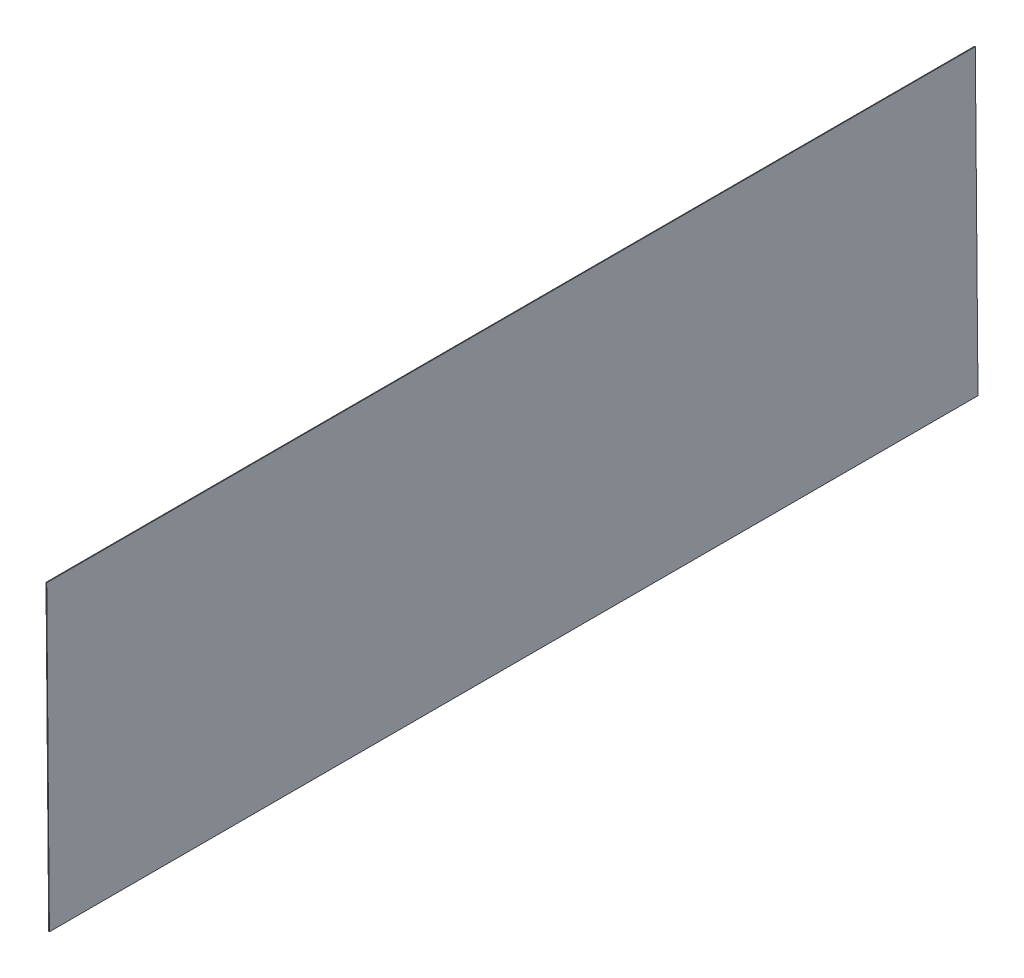
ISO-10303-21;
HEADER;
FILE_DESCRIPTION(('STEP AP214'),'2;1');
FILE_NAME('part.step','',(''),(''),'','','');
FILE_SCHEMA(('AUTOMOTIVE_DESIGN { 1 0 10303 214 1 1 1 1 }'));
ENDSEC;
DATA;
#1=APPLICATION_CONTEXT('core data for automotive mechanical design processes');
#2=APPLICATION_PROTOCOL_DEFINITION('international standard','automotive_design',2000,#1);
#3=PRODUCT_CONTEXT('',#1,'mechanical');
#4=PRODUCT('Part','Part','',(#3));
#5=PRODUCT_RELATED_PRODUCT_CATEGORY('part','',(#4));
#6=PRODUCT_DEFINITION_FORMATION('','',#4);
#7=PRODUCT_DEFINITION_CONTEXT('part definition',#1,'design');
#8=PRODUCT_DEFINITION('design','',#6,#7);
#9=PRODUCT_DEFINITION_SHAPE('','',#8);
#10=(LENGTH_UNIT() NAMED_UNIT(*) SI_UNIT(.MILLI.,.METRE.));
#11=(NAMED_UNIT(*) PLANE_ANGLE_UNIT() SI_UNIT($,.RADIAN.));
#12=(NAMED_UNIT(*) SI_UNIT($,.STERADIAN.) SOLID_ANGLE_UNIT());
#13=UNCERTAINTY_MEASURE_WITH_UNIT(LENGTH_MEASURE(1.E-05),#10,'distance_accuracy_value','');
#14=(GEOMETRIC_REPRESENTATION_CONTEXT(3) GLOBAL_UNCERTAINTY_ASSIGNED_CONTEXT((#13)) GLOBAL_UNIT_ASSIGNED_CONTEXT((#10,
#11,#12)) REPRESENTATION_CONTEXT('',''));
#15=CARTESIAN_POINT('',(0.,0.,0.));
#16=DIRECTION('',(0.,0.,1.));
#17=DIRECTION('',(1.,0.,0.));
#18=AXIS2_PLACEMENT_3D('',#15,#16,#17);
#19=CARTESIAN_POINT('',(536.156752678118,4.78730468749933,5181.6));
#20=DIRECTION('',(0.00892857142857143,-0.999960139511694,0.));
#21=DIRECTION('',(0.,0.,1.));
#22=AXIS2_PLACEMENT_3D('',#19,#20,#21);
#23=PLANE('',#22);
#24=DIRECTION('',(-0.999960139511694,-0.00892857142857143,0.));
#25=VECTOR('',#24,1.);
#26=CARTESIAN_POINT('',(536.156752678118,4.78730468749888,0.));
#27=LINE('',#26,#25);
#28=CARTESIAN_POINT('',(541.315922022911,4.83337053571242,-1.77635683940025E-12));
#29=VERTEX_POINT('',#28);
#30=CARTESIAN_POINT('',(533.378738415537,4.76249999999823,-1.77635683940025E-12));
#31=VERTEX_POINT('',#30);
#32=EDGE_CURVE('E12',#29,#31,#27,.T.);
#33=ORIENTED_EDGE('',*,*,#32,.F.);
#34=DIRECTION('',(0.,0.,1.));
#35=VECTOR('',#34,1.);
#36=CARTESIAN_POINT('',(541.315922022911,4.83337053571242,5181.6));
#37=LINE('',#36,#35);
#38=CARTESIAN_POINT('',(541.315922022911,4.83337053571242,10363.2));
#39=VERTEX_POINT('',#38);
#40=EDGE_CURVE('E87',#29,#39,#37,.T.);
#41=ORIENTED_EDGE('',*,*,#40,.T.);
#42=DIRECTION('',(-0.999960139511694,-0.00892857142857143,0.));
#43=VECTOR('',#42,1.);
#44=CARTESIAN_POINT('',(536.156752678118,4.78730468749888,10363.2));
#45=LINE('',#44,#43);
#46=CARTESIAN_POINT('',(533.378738415537,4.76249999999823,10363.2));
#47=VERTEX_POINT('',#46);
#48=EDGE_CURVE('E59',#39,#47,#45,.T.);
#49=ORIENTED_EDGE('',*,*,#48,.T.);
#50=DIRECTION('',(0.,0.,1.));
#51=VECTOR('',#50,1.);
#52=CARTESIAN_POINT('',(533.378738415537,4.76249999999823,5181.6));
#53=LINE('',#52,#51);
#54=EDGE_CURVE('E89',#31,#47,#53,.T.);
#55=ORIENTED_EDGE('',*,*,#54,.F.);
#56=EDGE_LOOP('',(#33,#41,#49,#55));
#57=FACE_BOUND('',#56,.T.);
#58=ADVANCED_FACE('F49',(#57),#23,.T.);
#59=CARTESIAN_POINT('',(521.159735801164,1684.38624260386,10363.2));
#60=DIRECTION('',(0.,0.,-1.));
#61=DIRECTION('',(0.00892857142857143,-0.999960139511694,0.));
#62=AXIS2_PLACEMENT_3D('',#59,#60,#61);
#63=PLANE('',#62);
#64=ORIENTED_EDGE('',*,*,#48,.F.);
#65=DIRECTION('',(0.00892857142857143,-0.999960139511694,0.));
#66=VECTOR('',#65,1.);
#67=CARTESIAN_POINT('',(526.318905145957,1684.43230845207,10363.2));
#68=LINE('',#67,#66);
#69=CARTESIAN_POINT('',(511.321888269002,3364.03124636844,10363.2));
#70=VERTEX_POINT('',#69);
#71=EDGE_CURVE('E101',#39,#70,#68,.F.);
#72=ORIENTED_EDGE('',*,*,#71,.T.);
#73=DIRECTION('',(-0.999960139511694,-0.00892857142857143,0.));
#74=VECTOR('',#73,1.);
#75=CARTESIAN_POINT('',(506.162718924209,3363.98518052023,10363.2));
#76=LINE('',#75,#74);
#77=CARTESIAN_POINT('',(503.384704661628,3363.96037583273,10363.2));
#78=VERTEX_POINT('',#77);
#79=EDGE_CURVE('E110',#70,#78,#76,.T.);
#80=ORIENTED_EDGE('',*,*,#79,.T.);
#81=DIRECTION('',(0.00892857142857143,-0.999960139511694,0.));
#82=VECTOR('',#81,1.);
#83=CARTESIAN_POINT('',(518.381721538583,1684.36143791636,10363.2));
#84=LINE('',#83,#82);
#85=EDGE_CURVE('E105',#47,#78,#84,.F.);
#86=ORIENTED_EDGE('',*,*,#85,.F.);
#87=EDGE_LOOP('',(#64,#72,#80,#86));
#88=FACE_BOUND('',#87,.T.);
#89=ADVANCED_FACE('F118',(#88),#63,.F.);
#90=CARTESIAN_POINT('',(506.162718924209,3363.98518052023,5181.6));
#91=DIRECTION('',(0.00892857142857143,-0.999960139511694,0.));
#92=DIRECTION('',(0.,0.,1.));
#93=AXIS2_PLACEMENT_3D('',#90,#91,#92);
#94=PLANE('',#93);
#95=ORIENTED_EDGE('',*,*,#79,.F.);
#96=DIRECTION('',(0.,0.,1.));
#97=VECTOR('',#96,1.);
#98=CARTESIAN_POINT('',(511.321888269002,3364.03124636844,5181.6));
#99=LINE('',#98,#97);
#100=CARTESIAN_POINT('',(511.321888269002,3364.03124636844,-1.77635683940025E-12));
#101=VERTEX_POINT('',#100);
#102=EDGE_CURVE('E103',#70,#101,#99,.F.);
#103=ORIENTED_EDGE('',*,*,#102,.T.);
#104=DIRECTION('',(-0.999960139511694,-0.00892857142857143,0.));
#105=VECTOR('',#104,1.);
#106=CARTESIAN_POINT('',(506.162718924209,3363.98518052023,0.));
#107=LINE('',#106,#105);
#108=CARTESIAN_POINT('',(503.384704661628,3363.96037583273,-1.77635683940025E-12));
#109=VERTEX_POINT('',#108);
#110=EDGE_CURVE('E53',#101,#109,#107,.T.);
#111=ORIENTED_EDGE('',*,*,#110,.T.);
#112=DIRECTION('',(0.,0.,1.));
#113=VECTOR('',#112,1.);
#114=CARTESIAN_POINT('',(503.384704661628,3363.96037583273,5181.6));
#115=LINE('',#114,#113);
#116=EDGE_CURVE('E119',#78,#109,#115,.F.);
#117=ORIENTED_EDGE('',*,*,#116,.F.);
#118=EDGE_LOOP('',(#95,#103,#111,#117));
#119=FACE_BOUND('',#118,.T.);
#120=ADVANCED_FACE('F123',(#119),#94,.F.);
#121=CARTESIAN_POINT('',(521.159735801164,1684.38624260386,-1.77635683940025E-12));
#122=DIRECTION('',(0.,0.,-1.));
#123=DIRECTION('',(0.00892857142857143,-0.999960139511694,0.));
#124=AXIS2_PLACEMENT_3D('',#121,#122,#123);
#125=PLANE('',#124);
#126=DIRECTION('',(0.00892857142857143,-0.999960139511694,0.));
#127=VECTOR('',#126,1.);
#128=CARTESIAN_POINT('',(526.318905145957,1684.43230845207,-1.77635683940025E-12));
#129=LINE('',#128,#127);
#130=EDGE_CURVE('E99',#101,#29,#129,.T.);
#131=ORIENTED_EDGE('',*,*,#130,.T.);
#132=ORIENTED_EDGE('',*,*,#32,.T.);
#133=DIRECTION('',(0.00892857142857143,-0.999960139511694,0.));
#134=VECTOR('',#133,1.);
#135=CARTESIAN_POINT('',(518.381721538583,1684.36143791636,-1.77635683940025E-12));
#136=LINE('',#135,#134);
#137=EDGE_CURVE('E117',#109,#31,#136,.T.);
#138=ORIENTED_EDGE('',*,*,#137,.F.);
#139=ORIENTED_EDGE('',*,*,#110,.F.);
#140=EDGE_LOOP('',(#131,#132,#138,#139));
#141=FACE_BOUND('',#140,.T.);
#142=ADVANCED_FACE('F51',(#141),#125,.T.);
#143=CARTESIAN_POINT('',(518.381721538583,1684.36143791636,5181.6));
#144=DIRECTION('',(-0.999960139511694,-0.00892857142857143,0.));
#145=DIRECTION('',(0.00892857142857143,-0.999960139511694,0.));
#146=AXIS2_PLACEMENT_3D('',#143,#144,#145);
#147=PLANE('',#146);
#148=ORIENTED_EDGE('',*,*,#116,.T.);
#149=ORIENTED_EDGE('',*,*,#137,.T.);
#150=ORIENTED_EDGE('',*,*,#54,.T.);
#151=ORIENTED_EDGE('',*,*,#85,.T.);
#152=EDGE_LOOP('',(#148,#149,#150,#151));
#153=FACE_BOUND('',#152,.T.);
#154=ADVANCED_FACE('F116',(#153),#147,.T.);
#155=CARTESIAN_POINT('',(526.318905145957,1684.43230845207,5181.6));
#156=DIRECTION('',(-0.999960139511694,-0.00892857142857143,0.));
#157=DIRECTION('',(0.00892857142857143,-0.999960139511694,0.));
#158=AXIS2_PLACEMENT_3D('',#155,#156,#157);
#159=PLANE('',#158);
#160=ORIENTED_EDGE('',*,*,#102,.F.);
#161=ORIENTED_EDGE('',*,*,#71,.F.);
#162=ORIENTED_EDGE('',*,*,#40,.F.);
#163=ORIENTED_EDGE('',*,*,#130,.F.);
#164=EDGE_LOOP('',(#160,#161,#162,#163));
#165=FACE_BOUND('',#164,.T.);
#166=ADVANCED_FACE('F98',(#165),#159,.F.);
#167=CLOSED_SHELL('',(#58,#89,#120,#142,#154,#166));
#168=MANIFOLD_SOLID_BREP('B2',#167);
#169=ADVANCED_BREP_SHAPE_REPRESENTATION('',(#18,#168),#14);
#170=SHAPE_DEFINITION_REPRESENTATION(#9,#169);
ENDSEC;
END-ISO-10303-21;
